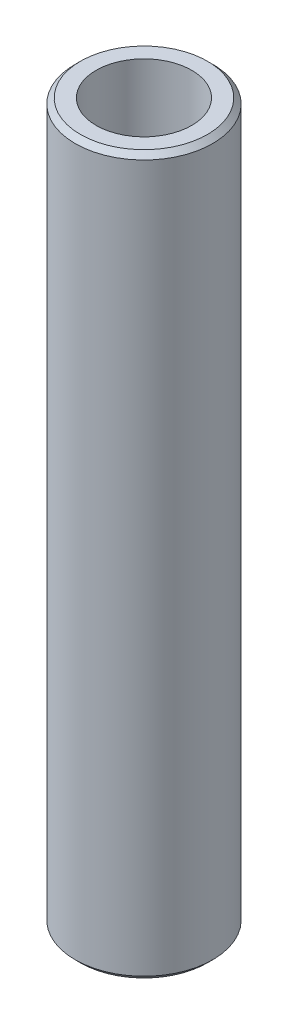
ISO-10303-21;
HEADER;
FILE_DESCRIPTION(('STEP AP214'),'2;1');
FILE_NAME('part.step','',(''),(''),'','','');
FILE_SCHEMA(('AUTOMOTIVE_DESIGN { 1 0 10303 214 1 1 1 1 }'));
ENDSEC;
DATA;
#1=APPLICATION_CONTEXT('core data for automotive mechanical design processes');
#2=APPLICATION_PROTOCOL_DEFINITION('international standard','automotive_design',2000,#1);
#3=PRODUCT_CONTEXT('',#1,'mechanical');
#4=PRODUCT('Part','Part','',(#3));
#5=PRODUCT_RELATED_PRODUCT_CATEGORY('part','',(#4));
#6=PRODUCT_DEFINITION_FORMATION('','',#4);
#7=PRODUCT_DEFINITION_CONTEXT('part definition',#1,'design');
#8=PRODUCT_DEFINITION('design','',#6,#7);
#9=PRODUCT_DEFINITION_SHAPE('','',#8);
#10=(LENGTH_UNIT() NAMED_UNIT(*) SI_UNIT(.MILLI.,.METRE.));
#11=(NAMED_UNIT(*) PLANE_ANGLE_UNIT() SI_UNIT($,.RADIAN.));
#12=(NAMED_UNIT(*) SI_UNIT($,.STERADIAN.) SOLID_ANGLE_UNIT());
#13=UNCERTAINTY_MEASURE_WITH_UNIT(LENGTH_MEASURE(1.E-05),#10,'distance_accuracy_value','');
#14=(GEOMETRIC_REPRESENTATION_CONTEXT(3) GLOBAL_UNCERTAINTY_ASSIGNED_CONTEXT((#13)) GLOBAL_UNIT_ASSIGNED_CONTEXT((#10,
#11,#12)) REPRESENTATION_CONTEXT('',''));
#15=CARTESIAN_POINT('',(0.,0.,0.));
#16=DIRECTION('',(0.,0.,1.));
#17=DIRECTION('',(1.,0.,0.));
#18=AXIS2_PLACEMENT_3D('',#15,#16,#17);
#19=CARTESIAN_POINT('',(0.,600.,0.));
#20=DIRECTION('',(0.,-1.,0.));
#21=DIRECTION('',(0.,0.,-1.));
#22=AXIS2_PLACEMENT_3D('',#19,#20,#21);
#23=CYLINDRICAL_SURFACE('',#22,57.5);
#24=CARTESIAN_POINT('',(0.,595.615003945622,0.));
#25=DIRECTION('',(0.,1.,0.));
#26=DIRECTION('',(0.,0.,1.));
#27=AXIS2_PLACEMENT_3D('',#24,#25,#26);
#28=CIRCLE('',#27,57.5);
#29=CARTESIAN_POINT('',(0.,595.615003945622,57.5));
#30=VERTEX_POINT('',#29);
#31=EDGE_CURVE('E50',#30,#30,#28,.F.);
#32=ORIENTED_EDGE('',*,*,#31,.T.);
#33=EDGE_LOOP('',(#32));
#34=FACE_BOUND('',#33,.T.);
#35=CARTESIAN_POINT('',(0.,4.38499605437859,0.));
#36=DIRECTION('',(0.,1.,0.));
#37=DIRECTION('',(0.,0.,1.));
#38=AXIS2_PLACEMENT_3D('',#35,#36,#37);
#39=CIRCLE('',#38,57.5);
#40=CARTESIAN_POINT('',(0.,4.38499605437859,57.5));
#41=VERTEX_POINT('',#40);
#42=EDGE_CURVE('E51',#41,#41,#39,.T.);
#43=ORIENTED_EDGE('',*,*,#42,.T.);
#44=EDGE_LOOP('',(#43));
#45=FACE_BOUND('',#44,.T.);
#46=ADVANCED_FACE('F39',(#34,#45),#23,.T.);
#47=CARTESIAN_POINT('',(0.,600.,0.));
#48=DIRECTION('',(0.,1.,0.));
#49=DIRECTION('',(0.,0.,1.));
#50=AXIS2_PLACEMENT_3D('',#47,#48,#49);
#51=PLANE('',#50);
#52=CARTESIAN_POINT('',(0.,600.,0.));
#53=DIRECTION('',(0.,1.,0.));
#54=DIRECTION('',(0.,0.,1.));
#55=AXIS2_PLACEMENT_3D('',#52,#53,#54);
#56=CIRCLE('',#55,53.1150039456216);
#57=CARTESIAN_POINT('',(0.,600.,53.1150039456216));
#58=VERTEX_POINT('',#57);
#59=EDGE_CURVE('E54',#58,#58,#56,.T.);
#60=ORIENTED_EDGE('',*,*,#59,.T.);
#61=EDGE_LOOP('',(#60));
#62=FACE_BOUND('',#61,.T.);
#63=CARTESIAN_POINT('',(0.,600.,0.));
#64=DIRECTION('',(0.,1.,0.));
#65=DIRECTION('',(0.,0.,1.));
#66=AXIS2_PLACEMENT_3D('',#63,#64,#65);
#67=CIRCLE('',#66,39.9863201367499);
#68=CARTESIAN_POINT('',(0.,600.,39.9863201367499));
#69=VERTEX_POINT('',#68);
#70=EDGE_CURVE('E58',#69,#69,#67,.T.);
#71=ORIENTED_EDGE('',*,*,#70,.F.);
#72=EDGE_LOOP('',(#71));
#73=FACE_BOUND('',#72,.T.);
#74=ADVANCED_FACE('F69',(#62,#73),#51,.T.);
#75=CARTESIAN_POINT('',(0.,0.,0.));
#76=DIRECTION('',(0.,1.,0.));
#77=DIRECTION('',(0.,0.,1.));
#78=AXIS2_PLACEMENT_3D('',#75,#76,#77);
#79=PLANE('',#78);
#80=CARTESIAN_POINT('',(0.,0.,0.));
#81=DIRECTION('',(0.,1.,0.));
#82=DIRECTION('',(0.,0.,1.));
#83=AXIS2_PLACEMENT_3D('',#80,#81,#82);
#84=CIRCLE('',#83,53.1150039456214);
#85=CARTESIAN_POINT('',(0.,0.,53.1150039456214));
#86=VERTEX_POINT('',#85);
#87=EDGE_CURVE('E10',#86,#86,#84,.F.);
#88=ORIENTED_EDGE('',*,*,#87,.T.);
#89=EDGE_LOOP('',(#88));
#90=FACE_BOUND('',#89,.T.);
#91=CARTESIAN_POINT('',(0.,0.,0.));
#92=DIRECTION('',(0.,1.,0.));
#93=DIRECTION('',(0.,0.,1.));
#94=AXIS2_PLACEMENT_3D('',#91,#92,#93);
#95=CIRCLE('',#94,39.9863201367499);
#96=CARTESIAN_POINT('',(0.,0.,39.9863201367499));
#97=VERTEX_POINT('',#96);
#98=EDGE_CURVE('E63',#97,#97,#95,.T.);
#99=ORIENTED_EDGE('',*,*,#98,.T.);
#100=EDGE_LOOP('',(#99));
#101=FACE_BOUND('',#100,.T.);
#102=ADVANCED_FACE('F75',(#90,#101),#79,.F.);
#103=CARTESIAN_POINT('',(0.,600.,0.));
#104=DIRECTION('',(0.,-1.,0.));
#105=DIRECTION('',(0.,0.,-1.));
#106=AXIS2_PLACEMENT_3D('',#103,#104,#105);
#107=CYLINDRICAL_SURFACE('',#106,39.9863201367499);
#108=ORIENTED_EDGE('',*,*,#70,.T.);
#109=EDGE_LOOP('',(#108));
#110=FACE_BOUND('',#109,.T.);
#111=ORIENTED_EDGE('',*,*,#98,.F.);
#112=EDGE_LOOP('',(#111));
#113=FACE_BOUND('',#112,.T.);
#114=ADVANCED_FACE('F70',(#110,#113),#107,.F.);
#115=CARTESIAN_POINT('',(0.,600.,0.));
#116=DIRECTION('',(0.,-1.,0.));
#117=DIRECTION('',(0.,0.,-1.));
#118=AXIS2_PLACEMENT_3D('',#115,#116,#117);
#119=CONICAL_SURFACE('',#118,53.1150039456216,0.785398163397455);
#120=ORIENTED_EDGE('',*,*,#31,.F.);
#121=EDGE_LOOP('',(#120));
#122=FACE_BOUND('',#121,.T.);
#123=ORIENTED_EDGE('',*,*,#59,.F.);
#124=EDGE_LOOP('',(#123));
#125=FACE_BOUND('',#124,.T.);
#126=ADVANCED_FACE('F81',(#122,#125),#119,.T.);
#127=CARTESIAN_POINT('',(0.,4.38499605437859,0.));
#128=DIRECTION('',(0.,1.,0.));
#129=DIRECTION('',(0.,0.,1.));
#130=AXIS2_PLACEMENT_3D('',#127,#128,#129);
#131=CONICAL_SURFACE('',#130,57.5,0.785398163397448);
#132=CARTESIAN_POINT('',(0.,0.,53.1150039456214));
#133=CARTESIAN_POINT('',(0.,0.0456770422331114,53.1606809878545));
#134=CARTESIAN_POINT('',(0.,0.091354084466221,53.2063580300876));
#135=CARTESIAN_POINT('',(0.,0.18270816893244,53.2977121145539));
#136=CARTESIAN_POINT('',(0.,0.22838521116555,53.343389156787));
#137=CARTESIAN_POINT('',(0.,0.319739295631771,53.4347432412532));
#138=CARTESIAN_POINT('',(0.,0.365416337864882,53.4804202834863));
#139=CARTESIAN_POINT('',(0.,0.456770422331102,53.5717743679525));
#140=CARTESIAN_POINT('',(0.,0.502447464564211,53.6174514101856));
#141=CARTESIAN_POINT('',(0.,0.593801549030432,53.7088054946518));
#142=CARTESIAN_POINT('',(0.,0.639478591263543,53.754482536885));
#143=CARTESIAN_POINT('',(0.,0.730832675729764,53.8458366213512));
#144=CARTESIAN_POINT('',(0.,0.776509717962873,53.8915136635843));
#145=CARTESIAN_POINT('',(0.,0.867863802429094,53.9828677480505));
#146=CARTESIAN_POINT('',(0.,0.913540844662205,54.0285447902836));
#147=CARTESIAN_POINT('',(0.,1.00489492912843,54.1198988747498));
#148=CARTESIAN_POINT('',(0.,1.05057197136153,54.1655759169829));
#149=CARTESIAN_POINT('',(0.,1.14192605582776,54.2569300014492));
#150=CARTESIAN_POINT('',(0.,1.18760309806087,54.3026070436823));
#151=CARTESIAN_POINT('',(0.,1.27895718252709,54.3939611281485));
#152=CARTESIAN_POINT('',(0.,1.3246342247602,54.4396381703816));
#153=CARTESIAN_POINT('',(0.,1.41598830922642,54.5309922548478));
#154=CARTESIAN_POINT('',(0.,1.46166535145953,54.5766692970809));
#155=CARTESIAN_POINT('',(0.,1.55301943592575,54.6680233815472));
#156=CARTESIAN_POINT('',(0.,1.59869647815886,54.7137004237803));
#157=CARTESIAN_POINT('',(0.,1.69005056262508,54.8050545082465));
#158=CARTESIAN_POINT('',(0.,1.73572760485819,54.8507315504796));
#159=CARTESIAN_POINT('',(0.,1.82708168932441,54.9420856349458));
#160=CARTESIAN_POINT('',(0.,1.87275873155752,54.9877626771789));
#161=CARTESIAN_POINT('',(0.,1.96411281602374,55.0791167616452));
#162=CARTESIAN_POINT('',(0.,2.00978985825685,55.1247938038783));
#163=CARTESIAN_POINT('',(0.,2.10114394272307,55.2161478883445));
#164=CARTESIAN_POINT('',(0.,2.14682098495618,55.2618249305776));
#165=CARTESIAN_POINT('',(0.,2.2381750694224,55.3531790150438));
#166=CARTESIAN_POINT('',(0.,2.28385211165551,55.3988560572769));
#167=CARTESIAN_POINT('',(0.,2.37520619612173,55.4902101417431));
#168=CARTESIAN_POINT('',(0.,2.42088323835484,55.5358871839763));
#169=CARTESIAN_POINT('',(0.,2.51223732282106,55.6272412684425));
#170=CARTESIAN_POINT('',(0.,2.55791436505418,55.6729183106756));
#171=CARTESIAN_POINT('',(0.,2.6492684495204,55.7642723951418));
#172=CARTESIAN_POINT('',(0.,2.69494549175351,55.8099494373749));
#173=CARTESIAN_POINT('',(0.,2.78629957621973,55.9013035218411));
#174=CARTESIAN_POINT('',(0.,2.83197661845284,55.9469805640743));
#175=CARTESIAN_POINT('',(0.,2.92333070291906,56.0383346485405));
#176=CARTESIAN_POINT('',(0.,2.96900774515217,56.0840116907736));
#177=CARTESIAN_POINT('',(0.,3.06036182961839,56.1753657752398));
#178=CARTESIAN_POINT('',(0.,3.1060388718515,56.2210428174729));
#179=CARTESIAN_POINT('',(0.,3.19739295631772,56.3123969019391));
#180=CARTESIAN_POINT('',(0.,3.24306999855083,56.3580739441722));
#181=CARTESIAN_POINT('',(0.,3.33442408301705,56.4494280286385));
#182=CARTESIAN_POINT('',(0.,3.38010112525016,56.4951050708716));
#183=CARTESIAN_POINT('',(0.,3.47145520971638,56.5864591553378));
#184=CARTESIAN_POINT('',(0.,3.51713225194949,56.6321361975709));
#185=CARTESIAN_POINT('',(0.,3.60848633641571,56.7234902820371));
#186=CARTESIAN_POINT('',(0.,3.65416337864882,56.7691673242702));
#187=CARTESIAN_POINT('',(0.,3.74551746311504,56.8605214087365));
#188=CARTESIAN_POINT('',(0.,3.79119450534815,56.9061984509696));
#189=CARTESIAN_POINT('',(0.,3.88254858981437,56.9975525354358));
#190=CARTESIAN_POINT('',(0.,3.92822563204748,57.0432295776689));
#191=CARTESIAN_POINT('',(0.,4.0195797165137,57.1345836621351));
#192=CARTESIAN_POINT('',(0.,4.06525675874681,57.1802607043682));
#193=CARTESIAN_POINT('',(0.,4.15661084321303,57.2716147888344));
#194=CARTESIAN_POINT('',(0.,4.20228788544614,57.3172918310676));
#195=CARTESIAN_POINT('',(0.,4.29364196991237,57.4086459155338));
#196=CARTESIAN_POINT('',(0.,4.33931901214548,57.4543229577669));
#197=CARTESIAN_POINT('',(0.,4.38499605437859,57.5));
#198=B_SPLINE_CURVE_WITH_KNOTS('',3,(#132,#133,#134,#135,#136,#137,#138,#139,#140,#141,#142,
#143,#144,#145,#146,#147,#148,#149,#150,#151,#152,#153,#154,#155,#156,#157,#158,#159,#160,#161,
#162,#163,#164,#165,#166,#167,#168,#169,#170,#171,#172,#173,#174,#175,#176,#177,#178,#179,#180,
#181,#182,#183,#184,#185,#186,#187,#188,#189,#190,#191,#192,#193,#194,#195,#196,#197),
.UNSPECIFIED.,.F.,.F.,(4,2,2,2,2,2,2,2,2,2,2,2,2,2,2,2,2,2,2,2,2,2,2,2,2,2,2,2,2,2,2,2,4),(0.,
0.193791277845457,0.387582555690919,0.581373833536376,0.775165111381838,0.968956389227295,
1.16274766707276,1.35653894491821,1.55033022276368,1.74412150060913,1.9379127784546,
2.13170405630005,2.32549533414552,2.51928661199097,2.71307788983643,2.90686916768189,
3.10066044552735,3.29445172337281,3.48824300121827,3.68203427906373,3.87582555690919,
4.06961683475465,4.26340811260011,4.45719939044557,4.65099066829103,4.84478194613649,
5.03857322398195,5.23236450182741,5.42615577967287,5.61994705751833,5.81373833536379,
6.00752961320925,6.20132089105471),.UNSPECIFIED.);
#199=EDGE_CURVE('BSEAM45',#86,#41,#198,.T.);
#200=ORIENTED_EDGE('',*,*,#87,.F.);
#201=ORIENTED_EDGE('',*,*,#42,.F.);
#202=ORIENTED_EDGE('',*,*,#199,.T.);
#203=ORIENTED_EDGE('',*,*,#199,.F.);
#204=EDGE_LOOP('',(#200,#202,#201,#203));
#205=FACE_BOUND('',#204,.T.);
#206=ADVANCED_FACE('F45',(#205),#131,.T.);
#207=CLOSED_SHELL('',(#46,#74,#102,#114,#126,#206));
#208=MANIFOLD_SOLID_BREP('B2',#207);
#209=ADVANCED_BREP_SHAPE_REPRESENTATION('',(#18,#208),#14);
#210=SHAPE_DEFINITION_REPRESENTATION(#9,#209);
ENDSEC;
END-ISO-10303-21;
